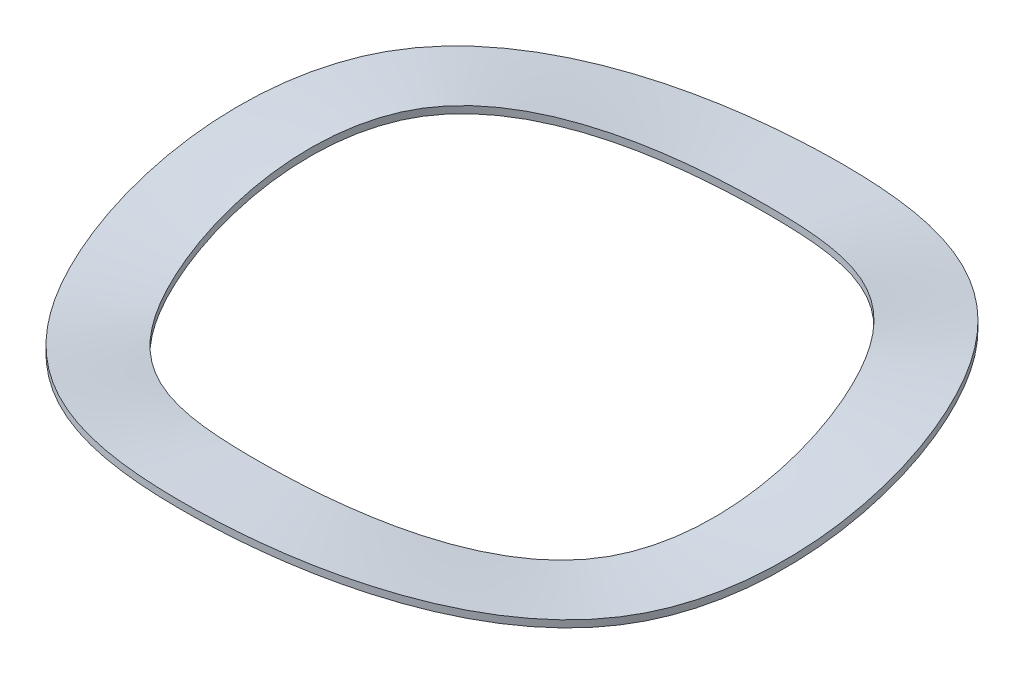
ISO-10303-21;
HEADER;
FILE_DESCRIPTION(('STEP AP214'),'2;1');
FILE_NAME('part.step','',(''),(''),'','','');
FILE_SCHEMA(('AUTOMOTIVE_DESIGN { 1 0 10303 214 1 1 1 1 }'));
ENDSEC;
DATA;
#1=APPLICATION_CONTEXT('core data for automotive mechanical design processes');
#2=APPLICATION_PROTOCOL_DEFINITION('international standard','automotive_design',2000,#1);
#3=PRODUCT_CONTEXT('',#1,'mechanical');
#4=PRODUCT('Part','Part','',(#3));
#5=PRODUCT_RELATED_PRODUCT_CATEGORY('part','',(#4));
#6=PRODUCT_DEFINITION_FORMATION('','',#4);
#7=PRODUCT_DEFINITION_CONTEXT('part definition',#1,'design');
#8=PRODUCT_DEFINITION('design','',#6,#7);
#9=PRODUCT_DEFINITION_SHAPE('','',#8);
#10=(LENGTH_UNIT() NAMED_UNIT(*) SI_UNIT(.MILLI.,.METRE.));
#11=(NAMED_UNIT(*) PLANE_ANGLE_UNIT() SI_UNIT($,.RADIAN.));
#12=(NAMED_UNIT(*) SI_UNIT($,.STERADIAN.) SOLID_ANGLE_UNIT());
#13=UNCERTAINTY_MEASURE_WITH_UNIT(LENGTH_MEASURE(1.E-05),#10,'distance_accuracy_value','');
#14=(GEOMETRIC_REPRESENTATION_CONTEXT(3) GLOBAL_UNCERTAINTY_ASSIGNED_CONTEXT((#13)) GLOBAL_UNIT_ASSIGNED_CONTEXT((#10,
#11,#12)) REPRESENTATION_CONTEXT('',''));
#15=CARTESIAN_POINT('',(0.,0.,0.));
#16=DIRECTION('',(0.,0.,1.));
#17=DIRECTION('',(1.,0.,0.));
#18=AXIS2_PLACEMENT_3D('',#15,#16,#17);
#19=CARTESIAN_POINT('',(0.,0.292099999999999,-13.716));
#20=CARTESIAN_POINT('',(4.75136177532294,0.292099999999999,-13.716));
#21=CARTESIAN_POINT('',(14.2540853259689,3.4163,-8.2296));
#22=CARTESIAN_POINT('',(14.2540853259688,-1.27,8.22960000000003));
#23=CARTESIAN_POINT('',(0.,3.4163,16.4592));
#24=CARTESIAN_POINT('',(-14.2540853259689,-1.27,8.22959999999994));
#25=CARTESIAN_POINT('',(-14.2540853259688,1.8542,-2.74320000000006));
#26=CARTESIAN_POINT('',(-9.50272355064585,1.8542,-10.9728));
#27=CARTESIAN_POINT('',(-4.75136177532293,0.2921,-13.716));
#28=CARTESIAN_POINT('',(0.,0.292099999999999,-13.716));
#29=CARTESIAN_POINT('',(0.,0.292099999999999,-12.6957666666667));
#30=CARTESIAN_POINT('',(4.3979425815412,0.292099999999999,-12.6957666666667));
#31=CARTESIAN_POINT('',(13.1938277446236,3.4163,-7.61746));
#32=CARTESIAN_POINT('',(13.1938277446236,-1.27,7.61746000000003));
#33=CARTESIAN_POINT('',(0.,3.4163,15.23492));
#34=CARTESIAN_POINT('',(-13.1938277446237,-1.27,7.61745999999995));
#35=CARTESIAN_POINT('',(-13.1938277446236,1.8542,-2.53915333333339));
#36=CARTESIAN_POINT('',(-8.79588516308238,1.8542,-10.1566133333334));
#37=CARTESIAN_POINT('',(-4.3979425815412,0.2921,-12.6957666666667));
#38=CARTESIAN_POINT('',(0.,0.292099999999999,-12.6957666666667));
#39=CARTESIAN_POINT('',(0.,0.292099999999999,-11.6755333333333));
#40=CARTESIAN_POINT('',(4.04452338775947,0.292099999999998,-11.6755333333333));
#41=CARTESIAN_POINT('',(12.1335701632784,3.4163,-7.00532));
#42=CARTESIAN_POINT('',(12.1335701632784,-1.27,7.00532000000003));
#43=CARTESIAN_POINT('',(0.,3.4163,14.01064));
#44=CARTESIAN_POINT('',(-12.1335701632785,-1.27000000000001,7.00531999999996));
#45=CARTESIAN_POINT('',(-12.1335701632784,1.8542,-2.33510666666672));
#46=CARTESIAN_POINT('',(-8.08904677551891,1.8542,-9.34042666666671));
#47=CARTESIAN_POINT('',(-4.04452338775946,0.2921,-11.6755333333333));
#48=CARTESIAN_POINT('',(0.,0.292099999999999,-11.6755333333333));
#49=CARTESIAN_POINT('',(0.,0.292099999999999,-10.6553));
#50=CARTESIAN_POINT('',(3.69110419397773,0.292099999999999,-10.6553));
#51=CARTESIAN_POINT('',(11.0733125819332,3.4163,-6.39318));
#52=CARTESIAN_POINT('',(11.0733125819332,-1.27,6.39318000000003));
#53=CARTESIAN_POINT('',(0.,3.4163,12.78636));
#54=CARTESIAN_POINT('',(-11.0733125819332,-1.27000000000001,6.39317999999997));
#55=CARTESIAN_POINT('',(-11.0733125819332,1.8542,-2.13106000000005));
#56=CARTESIAN_POINT('',(-7.38220838795543,1.8542,-8.52424000000004));
#57=CARTESIAN_POINT('',(-3.69110419397772,0.2921,-10.6553));
#58=CARTESIAN_POINT('',(0.,0.292099999999999,-10.6553));
#59=B_SPLINE_SURFACE_WITH_KNOTS('',3,3,((#19,#20,#21,#22,#23,#24,#25,#26,#27,#28),(#29,#30,#31,
#32,#33,#34,#35,#36,#37,#38),(#39,#40,#41,#42,#43,#44,#45,#46,#47,#48),(#49,#50,#51,#52,#53,#54,
#55,#56,#57,#58)),.UNSPECIFIED.,.F.,.T.,.F.,(4,4),(4,1,1,1,1,2,4),(0.,1.),(0.,0.166666666666667,
0.333333333333334,0.5,0.666666666666666,0.833333333333333,1.),.UNSPECIFIED.);
#60=CARTESIAN_POINT('',(0.,0.292099999999999,-13.716));
#61=CARTESIAN_POINT('',(4.75136177532294,0.292099999999999,-13.716));
#62=CARTESIAN_POINT('',(14.2540853259689,3.4163,-8.2296));
#63=CARTESIAN_POINT('',(14.2540853259688,-1.27,8.22960000000003));
#64=CARTESIAN_POINT('',(0.,3.4163,16.4592));
#65=CARTESIAN_POINT('',(-14.2540853259689,-1.27,8.22959999999994));
#66=CARTESIAN_POINT('',(-14.2540853259688,1.8542,-2.74320000000006));
#67=CARTESIAN_POINT('',(-9.50272355064585,1.8542,-10.9728));
#68=CARTESIAN_POINT('',(-4.75136177532293,0.2921,-13.716));
#69=CARTESIAN_POINT('',(0.,0.292099999999999,-13.716));
#70=B_SPLINE_CURVE_WITH_KNOTS('',3,(#60,#61,#62,#63,#64,#65,#66,#67,#68,#69),.UNSPECIFIED.,.T.,
.F.,(4,1,1,1,1,2,4),(0.,0.166666666666667,0.333333333333334,0.5,0.666666666666666,
0.833333333333333,1.),.UNSPECIFIED.);
#71=CARTESIAN_POINT('',(0.,0.292099999999999,-13.716));
#72=VERTEX_POINT('',#71);
#73=EDGE_CURVE('E31',#72,#72,#70,.T.);
#74=CARTESIAN_POINT('',(0.,0.292099999999999,-10.6553));
#75=CARTESIAN_POINT('',(3.69110419397773,0.292099999999999,-10.6553));
#76=CARTESIAN_POINT('',(11.0733125819332,3.4163,-6.39318));
#77=CARTESIAN_POINT('',(11.0733125819332,-1.27,6.39318000000003));
#78=CARTESIAN_POINT('',(0.,3.4163,12.78636));
#79=CARTESIAN_POINT('',(-11.0733125819332,-1.27000000000001,6.39317999999996));
#80=CARTESIAN_POINT('',(-11.0733125819332,1.8542,-2.13106000000005));
#81=CARTESIAN_POINT('',(-7.38220838795543,1.8542,-8.52424000000004));
#82=CARTESIAN_POINT('',(-3.69110419397772,0.2921,-10.6553));
#83=CARTESIAN_POINT('',(0.,0.292099999999999,-10.6553));
#84=B_SPLINE_CURVE_WITH_KNOTS('',3,(#74,#75,#76,#77,#78,#79,#80,#81,#82,#83),.UNSPECIFIED.,.T.,
.F.,(4,1,1,1,1,2,4),(0.,0.166666666666667,0.333333333333334,0.5,0.666666666666666,
0.833333333333333,1.),.UNSPECIFIED.);
#85=CARTESIAN_POINT('',(0.,0.292099999999999,-10.6553));
#86=VERTEX_POINT('',#85);
#87=EDGE_CURVE('E20',#86,#86,#84,.F.);
#88=ORIENTED_EDGE('',*,*,#73,.F.);
#89=EDGE_LOOP('',(#88));
#90=FACE_BOUND('',#89,.T.);
#91=ORIENTED_EDGE('',*,*,#87,.F.);
#92=EDGE_LOOP('',(#91));
#93=FACE_BOUND('',#92,.T.);
#94=ADVANCED_FACE('F14',(#90,#93),#59,.T.);
#95=CARTESIAN_POINT('',(0.,0.292099999999999,-10.6553));
#96=CARTESIAN_POINT('',(3.69110419397773,0.292099999999999,-10.6553));
#97=CARTESIAN_POINT('',(11.0733125819332,3.4163,-6.39318));
#98=CARTESIAN_POINT('',(11.0733125819332,-1.27,6.39318000000003));
#99=CARTESIAN_POINT('',(0.,3.4163,12.78636));
#100=CARTESIAN_POINT('',(-11.0733125819332,-1.27000000000001,6.39317999999996));
#101=CARTESIAN_POINT('',(-11.0733125819332,1.8542,-2.13106000000005));
#102=CARTESIAN_POINT('',(-7.38220838795543,1.8542,-8.52424000000004));
#103=CARTESIAN_POINT('',(-3.69110419397772,0.2921,-10.6553));
#104=CARTESIAN_POINT('',(0.,0.292099999999999,-10.6553));
#105=CARTESIAN_POINT('',(0.,0.194733333333333,-10.6553));
#106=CARTESIAN_POINT('',(3.69110419397773,0.194733333333332,-10.6553));
#107=CARTESIAN_POINT('',(11.0733125819332,3.31893333333334,-6.39318));
#108=CARTESIAN_POINT('',(11.0733125819332,-1.36736666666667,6.39318000000003));
#109=CARTESIAN_POINT('',(0.,3.31893333333333,12.78636));
#110=CARTESIAN_POINT('',(-11.0733125819332,-1.36736666666667,6.39317999999996));
#111=CARTESIAN_POINT('',(-11.0733125819332,1.75683333333333,-2.13106000000005));
#112=CARTESIAN_POINT('',(-7.38220838795543,1.75683333333334,-8.52424000000004));
#113=CARTESIAN_POINT('',(-3.69110419397772,0.194733333333333,-10.6553));
#114=CARTESIAN_POINT('',(0.,0.194733333333333,-10.6553));
#115=CARTESIAN_POINT('',(0.,0.0973666666666658,-10.6553));
#116=CARTESIAN_POINT('',(3.69110419397773,0.0973666666666655,-10.6553));
#117=CARTESIAN_POINT('',(11.0733125819332,3.22156666666667,-6.39318));
#118=CARTESIAN_POINT('',(11.0733125819332,-1.46473333333333,6.39318000000003));
#119=CARTESIAN_POINT('',(0.,3.22156666666666,12.78636));
#120=CARTESIAN_POINT('',(-11.0733125819332,-1.46473333333333,6.39317999999996));
#121=CARTESIAN_POINT('',(-11.0733125819332,1.65946666666666,-2.13106000000005));
#122=CARTESIAN_POINT('',(-7.38220838795543,1.65946666666667,-8.52424000000004));
#123=CARTESIAN_POINT('',(-3.69110419397772,0.0973666666666661,-10.6553));
#124=CARTESIAN_POINT('',(0.,0.0973666666666658,-10.6553));
#125=CARTESIAN_POINT('',(0.,0.,-10.6553));
#126=CARTESIAN_POINT('',(3.69110419397773,0.,-10.6553));
#127=CARTESIAN_POINT('',(11.0733125819332,3.1242,-6.39318));
#128=CARTESIAN_POINT('',(11.0733125819332,-1.5621,6.39318000000003));
#129=CARTESIAN_POINT('',(0.,3.12419999999999,12.78636));
#130=CARTESIAN_POINT('',(-11.0733125819332,-1.5621,6.39317999999996));
#131=CARTESIAN_POINT('',(-11.0733125819332,1.5621,-2.13106000000005));
#132=CARTESIAN_POINT('',(-7.38220838795543,1.5621,-8.52424000000004));
#133=CARTESIAN_POINT('',(-3.69110419397772,0.,-10.6553));
#134=CARTESIAN_POINT('',(0.,0.,-10.6553));
#135=B_SPLINE_SURFACE_WITH_KNOTS('',3,3,((#95,#96,#97,#98,#99,#100,#101,#102,#103,#104),(#105,
#106,#107,#108,#109,#110,#111,#112,#113,#114),(#115,#116,#117,#118,#119,#120,#121,#122,#123,
#124),(#125,#126,#127,#128,#129,#130,#131,#132,#133,#134)),.UNSPECIFIED.,.F.,.T.,.F.,(4,4),(4,1,
1,1,1,2,4),(0.,1.),(0.,0.166666666666667,0.333333333333334,0.5,0.666666666666666,
0.833333333333333,1.),.UNSPECIFIED.);
#136=CARTESIAN_POINT('',(0.,0.,-10.6553));
#137=CARTESIAN_POINT('',(3.69110419397773,0.,-10.6553));
#138=CARTESIAN_POINT('',(11.0733125819332,3.1242,-6.39318));
#139=CARTESIAN_POINT('',(11.0733125819332,-1.5621,6.39318000000003));
#140=CARTESIAN_POINT('',(0.,3.12419999999999,12.78636));
#141=CARTESIAN_POINT('',(-11.0733125819332,-1.5621,6.39317999999996));
#142=CARTESIAN_POINT('',(-11.0733125819332,1.5621,-2.13106000000005));
#143=CARTESIAN_POINT('',(-7.38220838795543,1.5621,-8.52424000000004));
#144=CARTESIAN_POINT('',(-3.69110419397772,0.,-10.6553));
#145=CARTESIAN_POINT('',(0.,0.,-10.6553));
#146=B_SPLINE_CURVE_WITH_KNOTS('',3,(#136,#137,#138,#139,#140,#141,#142,#143,#144,#145),
.UNSPECIFIED.,.T.,.F.,(4,1,1,1,1,2,4),(0.,0.166666666666667,0.333333333333334,0.5,
0.666666666666666,0.833333333333333,1.),.UNSPECIFIED.);
#147=CARTESIAN_POINT('',(0.,0.,-10.6553));
#148=VERTEX_POINT('',#147);
#149=EDGE_CURVE('E26',#148,#148,#146,.F.);
#150=ORIENTED_EDGE('',*,*,#87,.T.);
#151=EDGE_LOOP('',(#150));
#152=FACE_BOUND('',#151,.T.);
#153=ORIENTED_EDGE('',*,*,#149,.F.);
#154=EDGE_LOOP('',(#153));
#155=FACE_BOUND('',#154,.T.);
#156=ADVANCED_FACE('F54',(#152,#155),#135,.T.);
#157=CARTESIAN_POINT('',(0.,0.,-13.716));
#158=CARTESIAN_POINT('',(4.75136177532294,0.,-13.716));
#159=CARTESIAN_POINT('',(14.2540853259689,3.1242,-8.2296));
#160=CARTESIAN_POINT('',(14.2540853259688,-1.5621,8.22960000000003));
#161=CARTESIAN_POINT('',(0.,3.1242,16.4592));
#162=CARTESIAN_POINT('',(-14.2540853259689,-1.5621,8.22959999999994));
#163=CARTESIAN_POINT('',(-14.2540853259688,1.5621,-2.74320000000006));
#164=CARTESIAN_POINT('',(-9.50272355064585,1.5621,-10.9728));
#165=CARTESIAN_POINT('',(-4.75136177532293,0.,-13.716));
#166=CARTESIAN_POINT('',(0.,0.,-13.716));
#167=CARTESIAN_POINT('',(0.,0.0973666666666665,-13.716));
#168=CARTESIAN_POINT('',(4.75136177532294,0.0973666666666662,-13.716));
#169=CARTESIAN_POINT('',(14.2540853259689,3.22156666666667,-8.2296));
#170=CARTESIAN_POINT('',(14.2540853259688,-1.46473333333333,8.22960000000003));
#171=CARTESIAN_POINT('',(0.,3.22156666666666,16.4592));
#172=CARTESIAN_POINT('',(-14.2540853259689,-1.46473333333333,8.22959999999994));
#173=CARTESIAN_POINT('',(-14.2540853259688,1.65946666666666,-2.74320000000006));
#174=CARTESIAN_POINT('',(-9.50272355064585,1.65946666666667,-10.9728));
#175=CARTESIAN_POINT('',(-4.75136177532293,0.0973666666666667,-13.716));
#176=CARTESIAN_POINT('',(0.,0.0973666666666665,-13.716));
#177=CARTESIAN_POINT('',(0.,0.194733333333333,-13.716));
#178=CARTESIAN_POINT('',(4.75136177532294,0.194733333333333,-13.716));
#179=CARTESIAN_POINT('',(14.2540853259689,3.31893333333333,-8.2296));
#180=CARTESIAN_POINT('',(14.2540853259688,-1.36736666666666,8.22960000000003));
#181=CARTESIAN_POINT('',(0.,3.31893333333333,16.4592));
#182=CARTESIAN_POINT('',(-14.2540853259689,-1.36736666666667,8.22959999999994));
#183=CARTESIAN_POINT('',(-14.2540853259688,1.75683333333333,-2.74320000000006));
#184=CARTESIAN_POINT('',(-9.50272355064585,1.75683333333334,-10.9728));
#185=CARTESIAN_POINT('',(-4.75136177532293,0.194733333333333,-13.716));
#186=CARTESIAN_POINT('',(0.,0.194733333333333,-13.716));
#187=CARTESIAN_POINT('',(0.,0.292099999999999,-13.716));
#188=CARTESIAN_POINT('',(4.75136177532294,0.292099999999999,-13.716));
#189=CARTESIAN_POINT('',(14.2540853259689,3.4163,-8.2296));
#190=CARTESIAN_POINT('',(14.2540853259688,-1.27,8.22960000000003));
#191=CARTESIAN_POINT('',(0.,3.4163,16.4592));
#192=CARTESIAN_POINT('',(-14.2540853259689,-1.27,8.22959999999994));
#193=CARTESIAN_POINT('',(-14.2540853259688,1.8542,-2.74320000000006));
#194=CARTESIAN_POINT('',(-9.50272355064585,1.8542,-10.9728));
#195=CARTESIAN_POINT('',(-4.75136177532293,0.2921,-13.716));
#196=CARTESIAN_POINT('',(0.,0.292099999999999,-13.716));
#197=B_SPLINE_SURFACE_WITH_KNOTS('',3,3,((#157,#158,#159,#160,#161,#162,#163,#164,#165,#166),
(#167,#168,#169,#170,#171,#172,#173,#174,#175,#176),(#177,#178,#179,#180,#181,#182,#183,#184,
#185,#186),(#187,#188,#189,#190,#191,#192,#193,#194,#195,#196)),.UNSPECIFIED.,.F.,.T.,.F.,(4,4),
(4,1,1,1,1,2,4),(0.,1.),(0.,0.166666666666667,0.333333333333334,0.5,0.666666666666666,
0.833333333333333,1.),.UNSPECIFIED.);
#198=CARTESIAN_POINT('',(0.,0.,-13.716));
#199=CARTESIAN_POINT('',(4.75136177532294,0.,-13.716));
#200=CARTESIAN_POINT('',(14.2540853259689,3.1242,-8.2296));
#201=CARTESIAN_POINT('',(14.2540853259688,-1.5621,8.22960000000003));
#202=CARTESIAN_POINT('',(0.,3.1242,16.4592));
#203=CARTESIAN_POINT('',(-14.2540853259689,-1.5621,8.22959999999994));
#204=CARTESIAN_POINT('',(-14.2540853259688,1.5621,-2.74320000000006));
#205=CARTESIAN_POINT('',(-9.50272355064585,1.5621,-10.9728));
#206=CARTESIAN_POINT('',(-4.75136177532293,0.,-13.716));
#207=CARTESIAN_POINT('',(0.,0.,-13.716));
#208=B_SPLINE_CURVE_WITH_KNOTS('',3,(#198,#199,#200,#201,#202,#203,#204,#205,#206,#207),
.UNSPECIFIED.,.T.,.F.,(4,1,1,1,1,2,4),(0.,0.166666666666667,0.333333333333334,0.5,
0.666666666666666,0.833333333333333,1.),.UNSPECIFIED.);
#209=CARTESIAN_POINT('',(0.,0.,-13.716));
#210=VERTEX_POINT('',#209);
#211=EDGE_CURVE('E10',#210,#210,#208,.T.);
#212=ORIENTED_EDGE('',*,*,#73,.T.);
#213=EDGE_LOOP('',(#212));
#214=FACE_BOUND('',#213,.T.);
#215=ORIENTED_EDGE('',*,*,#211,.F.);
#216=EDGE_LOOP('',(#215));
#217=FACE_BOUND('',#216,.T.);
#218=ADVANCED_FACE('F64',(#214,#217),#197,.T.);
#219=CARTESIAN_POINT('',(0.,0.,-10.6553));
#220=CARTESIAN_POINT('',(3.69110419397773,0.,-10.6553));
#221=CARTESIAN_POINT('',(11.0733125819332,3.1242,-6.39318));
#222=CARTESIAN_POINT('',(11.0733125819332,-1.5621,6.39318000000003));
#223=CARTESIAN_POINT('',(0.,3.12419999999999,12.78636));
#224=CARTESIAN_POINT('',(-11.0733125819332,-1.5621,6.39317999999996));
#225=CARTESIAN_POINT('',(-11.0733125819332,1.5621,-2.13106000000005));
#226=CARTESIAN_POINT('',(-7.38220838795543,1.5621,-8.52424000000004));
#227=CARTESIAN_POINT('',(-3.69110419397772,0.,-10.6553));
#228=CARTESIAN_POINT('',(0.,0.,-10.6553));
#229=CARTESIAN_POINT('',(0.,0.,-11.6755333333333));
#230=CARTESIAN_POINT('',(4.04452338775946,0.,-11.6755333333333));
#231=CARTESIAN_POINT('',(12.1335701632784,3.1242,-7.00532));
#232=CARTESIAN_POINT('',(12.1335701632784,-1.5621,7.00532000000003));
#233=CARTESIAN_POINT('',(0.,3.1242,14.01064));
#234=CARTESIAN_POINT('',(-12.1335701632785,-1.5621,7.00531999999996));
#235=CARTESIAN_POINT('',(-12.1335701632784,1.5621,-2.33510666666672));
#236=CARTESIAN_POINT('',(-8.08904677551891,1.5621,-9.34042666666671));
#237=CARTESIAN_POINT('',(-4.04452338775946,0.,-11.6755333333333));
#238=CARTESIAN_POINT('',(0.,0.,-11.6755333333333));
#239=CARTESIAN_POINT('',(0.,0.,-12.6957666666667));
#240=CARTESIAN_POINT('',(4.3979425815412,0.,-12.6957666666667));
#241=CARTESIAN_POINT('',(13.1938277446236,3.1242,-7.61746));
#242=CARTESIAN_POINT('',(13.1938277446236,-1.5621,7.61746000000003));
#243=CARTESIAN_POINT('',(0.,3.1242,15.23492));
#244=CARTESIAN_POINT('',(-13.1938277446237,-1.5621,7.61745999999995));
#245=CARTESIAN_POINT('',(-13.1938277446236,1.5621,-2.53915333333339));
#246=CARTESIAN_POINT('',(-8.79588516308238,1.5621,-10.1566133333334));
#247=CARTESIAN_POINT('',(-4.3979425815412,0.,-12.6957666666667));
#248=CARTESIAN_POINT('',(0.,0.,-12.6957666666667));
#249=CARTESIAN_POINT('',(0.,0.,-13.716));
#250=CARTESIAN_POINT('',(4.75136177532294,0.,-13.716));
#251=CARTESIAN_POINT('',(14.2540853259689,3.1242,-8.2296));
#252=CARTESIAN_POINT('',(14.2540853259688,-1.5621,8.22960000000003));
#253=CARTESIAN_POINT('',(0.,3.1242,16.4592));
#254=CARTESIAN_POINT('',(-14.2540853259689,-1.5621,8.22959999999994));
#255=CARTESIAN_POINT('',(-14.2540853259688,1.5621,-2.74320000000006));
#256=CARTESIAN_POINT('',(-9.50272355064585,1.5621,-10.9728));
#257=CARTESIAN_POINT('',(-4.75136177532293,0.,-13.716));
#258=CARTESIAN_POINT('',(0.,0.,-13.716));
#259=B_SPLINE_SURFACE_WITH_KNOTS('',3,3,((#219,#220,#221,#222,#223,#224,#225,#226,#227,#228),
(#229,#230,#231,#232,#233,#234,#235,#236,#237,#238),(#239,#240,#241,#242,#243,#244,#245,#246,
#247,#248),(#249,#250,#251,#252,#253,#254,#255,#256,#257,#258)),.UNSPECIFIED.,.F.,.T.,.F.,(4,4),
(4,1,1,1,1,2,4),(0.,1.),(0.,0.166666666666667,0.333333333333334,0.5,0.666666666666666,
0.833333333333333,1.),.UNSPECIFIED.);
#260=ORIENTED_EDGE('',*,*,#149,.T.);
#261=EDGE_LOOP('',(#260));
#262=FACE_BOUND('',#261,.T.);
#263=ORIENTED_EDGE('',*,*,#211,.T.);
#264=EDGE_LOOP('',(#263));
#265=FACE_BOUND('',#264,.T.);
#266=ADVANCED_FACE('F16',(#262,#265),#259,.T.);
#267=CLOSED_SHELL('',(#94,#156,#218,#266));
#268=MANIFOLD_SOLID_BREP('B1',#267);
#269=ADVANCED_BREP_SHAPE_REPRESENTATION('',(#18,#268),#14);
#270=SHAPE_DEFINITION_REPRESENTATION(#9,#269);
ENDSEC;
END-ISO-10303-21;
